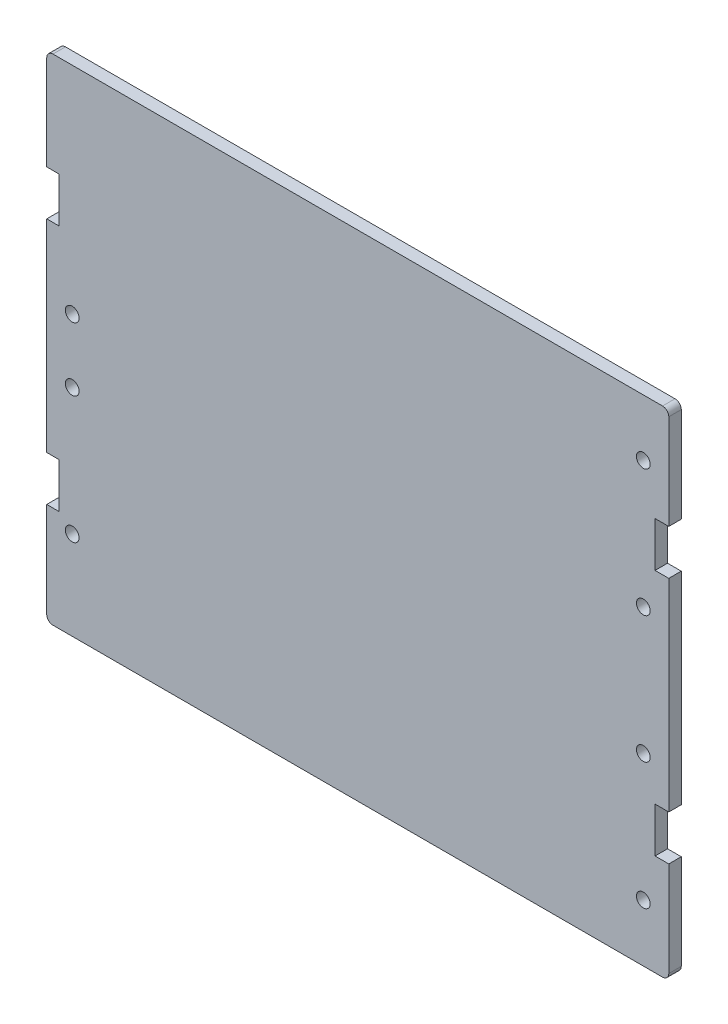
ISO-10303-21;
HEADER;
FILE_DESCRIPTION(('STEP AP214'),'2;1');
FILE_NAME('part.step','',(''),(''),'','','');
FILE_SCHEMA(('AUTOMOTIVE_DESIGN { 1 0 10303 214 1 1 1 1 }'));
ENDSEC;
DATA;
#1=APPLICATION_CONTEXT('core data for automotive mechanical design processes');
#2=APPLICATION_PROTOCOL_DEFINITION('international standard','automotive_design',2000,#1);
#3=PRODUCT_CONTEXT('',#1,'mechanical');
#4=PRODUCT('Part','Part','',(#3));
#5=PRODUCT_RELATED_PRODUCT_CATEGORY('part','',(#4));
#6=PRODUCT_DEFINITION_FORMATION('','',#4);
#7=PRODUCT_DEFINITION_CONTEXT('part definition',#1,'design');
#8=PRODUCT_DEFINITION('design','',#6,#7);
#9=PRODUCT_DEFINITION_SHAPE('','',#8);
#10=(LENGTH_UNIT() NAMED_UNIT(*) SI_UNIT(.MILLI.,.METRE.));
#11=(NAMED_UNIT(*) PLANE_ANGLE_UNIT() SI_UNIT($,.RADIAN.));
#12=(NAMED_UNIT(*) SI_UNIT($,.STERADIAN.) SOLID_ANGLE_UNIT());
#13=UNCERTAINTY_MEASURE_WITH_UNIT(LENGTH_MEASURE(1.E-05),#10,'distance_accuracy_value','');
#14=(GEOMETRIC_REPRESENTATION_CONTEXT(3) GLOBAL_UNCERTAINTY_ASSIGNED_CONTEXT((#13)) GLOBAL_UNIT_ASSIGNED_CONTEXT((#10,
#11,#12)) REPRESENTATION_CONTEXT('',''));
#15=CARTESIAN_POINT('',(0.,0.,0.));
#16=DIRECTION('',(0.,0.,1.));
#17=DIRECTION('',(1.,0.,0.));
#18=AXIS2_PLACEMENT_3D('',#15,#16,#17);
#19=CARTESIAN_POINT('',(-27.39,-21.78,8.3));
#20=DIRECTION('',(0.,0.,-1.));
#21=DIRECTION('',(-1.,0.,0.));
#22=AXIS2_PLACEMENT_3D('',#19,#20,#21);
#23=PLANE('',#22);
#24=CARTESIAN_POINT('',(-22.86,-2.54,8.3));
#25=DIRECTION('',(0.,0.,-1.));
#26=DIRECTION('',(-1.,0.,0.));
#27=AXIS2_PLACEMENT_3D('',#24,#25,#26);
#28=CIRCLE('',#27,0.550000000000003);
#29=CARTESIAN_POINT('',(-23.41,-2.54,8.3));
#30=VERTEX_POINT('',#29);
#31=EDGE_CURVE('E214',#30,#30,#28,.F.);
#32=ORIENTED_EDGE('',*,*,#31,.T.);
#33=EDGE_LOOP('',(#32));
#34=FACE_BOUND('',#33,.T.);
#35=CARTESIAN_POINT('',(22.86,15.26,8.3));
#36=DIRECTION('',(0.,0.,-1.));
#37=DIRECTION('',(-1.,0.,0.));
#38=AXIS2_PLACEMENT_3D('',#35,#36,#37);
#39=CIRCLE('',#38,0.549999999999998);
#40=CARTESIAN_POINT('',(22.31,15.26,8.3));
#41=VERTEX_POINT('',#40);
#42=EDGE_CURVE('E387',#41,#41,#39,.F.);
#43=ORIENTED_EDGE('',*,*,#42,.T.);
#44=EDGE_LOOP('',(#43));
#45=FACE_BOUND('',#44,.T.);
#46=CARTESIAN_POINT('',(22.86,-5.06000000000002,8.3));
#47=DIRECTION('',(0.,0.,-1.));
#48=DIRECTION('',(-1.,0.,0.));
#49=AXIS2_PLACEMENT_3D('',#46,#47,#48);
#50=CIRCLE('',#49,0.549999999999997);
#51=CARTESIAN_POINT('',(22.31,-5.06000000000002,8.3));
#52=VERTEX_POINT('',#51);
#53=EDGE_CURVE('E390',#52,#52,#50,.F.);
#54=ORIENTED_EDGE('',*,*,#53,.T.);
#55=EDGE_LOOP('',(#54));
#56=FACE_BOUND('',#55,.T.);
#57=CARTESIAN_POINT('',(22.86,-15.22,8.3));
#58=DIRECTION('',(0.,0.,-1.));
#59=DIRECTION('',(-1.,0.,0.));
#60=AXIS2_PLACEMENT_3D('',#57,#58,#59);
#61=CIRCLE('',#60,0.549999999999997);
#62=CARTESIAN_POINT('',(22.31,-15.22,8.3));
#63=VERTEX_POINT('',#62);
#64=EDGE_CURVE('E393',#63,#63,#61,.F.);
#65=ORIENTED_EDGE('',*,*,#64,.T.);
#66=EDGE_LOOP('',(#65));
#67=FACE_BOUND('',#66,.T.);
#68=CARTESIAN_POINT('',(22.86,5.09999999999998,8.3));
#69=DIRECTION('',(0.,0.,-1.));
#70=DIRECTION('',(-1.,0.,0.));
#71=AXIS2_PLACEMENT_3D('',#68,#69,#70);
#72=CIRCLE('',#71,0.549999999999997);
#73=CARTESIAN_POINT('',(22.31,5.09999999999998,8.3));
#74=VERTEX_POINT('',#73);
#75=EDGE_CURVE('E396',#74,#74,#72,.F.);
#76=ORIENTED_EDGE('',*,*,#75,.T.);
#77=EDGE_LOOP('',(#76));
#78=FACE_BOUND('',#77,.T.);
#79=CARTESIAN_POINT('',(-22.86,2.54,8.3));
#80=DIRECTION('',(0.,0.,-1.));
#81=DIRECTION('',(-1.,0.,0.));
#82=AXIS2_PLACEMENT_3D('',#79,#80,#81);
#83=CIRCLE('',#82,0.550000000000003);
#84=CARTESIAN_POINT('',(-23.41,2.54,8.3));
#85=VERTEX_POINT('',#84);
#86=EDGE_CURVE('E399',#85,#85,#83,.F.);
#87=ORIENTED_EDGE('',*,*,#86,.T.);
#88=EDGE_LOOP('',(#87));
#89=FACE_BOUND('',#88,.T.);
#90=CARTESIAN_POINT('',(-22.86,-12.7,8.3));
#91=DIRECTION('',(0.,0.,-1.));
#92=DIRECTION('',(-1.,0.,0.));
#93=AXIS2_PLACEMENT_3D('',#90,#91,#92);
#94=CIRCLE('',#93,0.550000000000002);
#95=CARTESIAN_POINT('',(-23.41,-12.7,8.3));
#96=VERTEX_POINT('',#95);
#97=EDGE_CURVE('E244',#96,#96,#94,.F.);
#98=ORIENTED_EDGE('',*,*,#97,.T.);
#99=EDGE_LOOP('',(#98));
#100=FACE_BOUND('',#99,.T.);
#101=DIRECTION('',(1.,0.,0.));
#102=VECTOR('',#101,1.);
#103=CARTESIAN_POINT('',(23.745,-11.7,8.3));
#104=LINE('',#103,#102);
#105=CARTESIAN_POINT('',(24.9,-11.7,8.3));
#106=VERTEX_POINT('',#105);
#107=CARTESIAN_POINT('',(23.8,-11.7,8.3));
#108=VERTEX_POINT('',#107);
#109=EDGE_CURVE('E340',#106,#108,#104,.F.);
#110=ORIENTED_EDGE('',*,*,#109,.F.);
#111=DIRECTION('',(0.,1.,0.));
#112=VECTOR('',#111,1.);
#113=CARTESIAN_POINT('',(24.9,-11.32,8.3));
#114=LINE('',#113,#112);
#115=CARTESIAN_POINT('',(24.9,-19.3,8.3));
#116=VERTEX_POINT('',#115);
#117=EDGE_CURVE('E343',#116,#106,#114,.T.);
#118=ORIENTED_EDGE('',*,*,#117,.F.);
#119=CARTESIAN_POINT('',(24.4,-19.3,8.3));
#120=DIRECTION('',(0.,0.,-1.));
#121=DIRECTION('',(-1.,0.,0.));
#122=AXIS2_PLACEMENT_3D('',#119,#120,#121);
#123=CIRCLE('',#122,0.500000000000035);
#124=CARTESIAN_POINT('',(24.4,-19.8,8.3));
#125=VERTEX_POINT('',#124);
#126=EDGE_CURVE('E190',#125,#116,#123,.F.);
#127=ORIENTED_EDGE('',*,*,#126,.F.);
#128=DIRECTION('',(1.,0.,0.));
#129=VECTOR('',#128,1.);
#130=CARTESIAN_POINT('',(-26.84,-19.8,8.3));
#131=LINE('',#130,#129);
#132=CARTESIAN_POINT('',(-24.4,-19.8,8.3));
#133=VERTEX_POINT('',#132);
#134=EDGE_CURVE('E188',#133,#125,#131,.T.);
#135=ORIENTED_EDGE('',*,*,#134,.F.);
#136=CARTESIAN_POINT('',(-24.4,-19.3,8.3));
#137=DIRECTION('',(0.,0.,-1.));
#138=DIRECTION('',(-1.,0.,0.));
#139=AXIS2_PLACEMENT_3D('',#136,#137,#138);
#140=CIRCLE('',#139,0.500000000000035);
#141=CARTESIAN_POINT('',(-24.9,-19.3,8.3));
#142=VERTEX_POINT('',#141);
#143=EDGE_CURVE('E20',#142,#133,#140,.F.);
#144=ORIENTED_EDGE('',*,*,#143,.F.);
#145=DIRECTION('',(0.,-1.,0.));
#146=VECTOR('',#145,1.);
#147=CARTESIAN_POINT('',(-24.9,-11.29375,8.3));
#148=LINE('',#147,#146);
#149=CARTESIAN_POINT('',(-24.9,-11.675,8.3));
#150=VERTEX_POINT('',#149);
#151=EDGE_CURVE('E186',#150,#142,#148,.T.);
#152=ORIENTED_EDGE('',*,*,#151,.F.);
#153=DIRECTION('',(1.,0.,0.));
#154=VECTOR('',#153,1.);
#155=CARTESIAN_POINT('',(-24.95,-11.675,8.3));
#156=LINE('',#155,#154);
#157=CARTESIAN_POINT('',(-23.9,-11.675,8.3));
#158=VERTEX_POINT('',#157);
#159=EDGE_CURVE('E207',#158,#150,#156,.F.);
#160=ORIENTED_EDGE('',*,*,#159,.F.);
#161=DIRECTION('',(0.,-1.,0.));
#162=VECTOR('',#161,1.);
#163=CARTESIAN_POINT('',(-23.9,-7.89500000000001,8.3));
#164=LINE('',#163,#162);
#165=CARTESIAN_POINT('',(-23.9,-8.07500000000001,8.3));
#166=VERTEX_POINT('',#165);
#167=EDGE_CURVE('E220',#166,#158,#164,.T.);
#168=ORIENTED_EDGE('',*,*,#167,.F.);
#169=DIRECTION('',(1.,0.,0.));
#170=VECTOR('',#169,1.);
#171=CARTESIAN_POINT('',(-24.95,-8.07500000000002,8.3));
#172=LINE('',#171,#170);
#173=CARTESIAN_POINT('',(-24.9,-8.07500000000002,8.3));
#174=VERTEX_POINT('',#173);
#175=EDGE_CURVE('E238',#174,#166,#172,.T.);
#176=ORIENTED_EDGE('',*,*,#175,.F.);
#177=DIRECTION('',(0.,-1.,0.));
#178=VECTOR('',#177,1.);
#179=CARTESIAN_POINT('',(-24.9,8.93499999999999,8.3));
#180=LINE('',#179,#178);
#181=CARTESIAN_POINT('',(-24.9,8.12499999999999,8.3));
#182=VERTEX_POINT('',#181);
#183=EDGE_CURVE('E247',#182,#174,#180,.T.);
#184=ORIENTED_EDGE('',*,*,#183,.F.);
#185=DIRECTION('',(1.,0.,0.));
#186=VECTOR('',#185,1.);
#187=CARTESIAN_POINT('',(-24.95,8.12499999999999,8.3));
#188=LINE('',#187,#186);
#189=CARTESIAN_POINT('',(-23.9,8.12499999999999,8.3));
#190=VERTEX_POINT('',#189);
#191=EDGE_CURVE('E257',#190,#182,#188,.F.);
#192=ORIENTED_EDGE('',*,*,#191,.F.);
#193=DIRECTION('',(0.,-1.,0.));
#194=VECTOR('',#193,1.);
#195=CARTESIAN_POINT('',(-23.9,11.905,8.3));
#196=LINE('',#195,#194);
#197=CARTESIAN_POINT('',(-23.9,11.725,8.3));
#198=VERTEX_POINT('',#197);
#199=EDGE_CURVE('E267',#198,#190,#196,.T.);
#200=ORIENTED_EDGE('',*,*,#199,.F.);
#201=DIRECTION('',(1.,0.,0.));
#202=VECTOR('',#201,1.);
#203=CARTESIAN_POINT('',(-24.95,11.725,8.3));
#204=LINE('',#203,#202);
#205=CARTESIAN_POINT('',(-24.9,11.725,8.3));
#206=VERTEX_POINT('',#205);
#207=EDGE_CURVE('E277',#206,#198,#204,.T.);
#208=ORIENTED_EDGE('',*,*,#207,.F.);
#209=DIRECTION('',(0.,-1.,0.));
#210=VECTOR('',#209,1.);
#211=CARTESIAN_POINT('',(-24.9,19.67875,8.3));
#212=LINE('',#211,#210);
#213=CARTESIAN_POINT('',(-24.9,19.3,8.3));
#214=VERTEX_POINT('',#213);
#215=EDGE_CURVE('E280',#214,#206,#212,.T.);
#216=ORIENTED_EDGE('',*,*,#215,.F.);
#217=CARTESIAN_POINT('',(-24.4,19.3,8.3));
#218=DIRECTION('',(0.,0.,-1.));
#219=DIRECTION('',(-1.,0.,0.));
#220=AXIS2_PLACEMENT_3D('',#217,#218,#219);
#221=CIRCLE('',#220,0.500000000000035);
#222=CARTESIAN_POINT('',(-24.4,19.8,8.3));
#223=VERTEX_POINT('',#222);
#224=EDGE_CURVE('E295',#223,#214,#221,.F.);
#225=ORIENTED_EDGE('',*,*,#224,.F.);
#226=DIRECTION('',(1.,0.,0.));
#227=VECTOR('',#226,1.);
#228=CARTESIAN_POINT('',(-26.84,19.8,8.3));
#229=LINE('',#228,#227);
#230=CARTESIAN_POINT('',(24.4,19.8,8.3));
#231=VERTEX_POINT('',#230);
#232=EDGE_CURVE('E292',#231,#223,#229,.F.);
#233=ORIENTED_EDGE('',*,*,#232,.F.);
#234=CARTESIAN_POINT('',(24.4,19.3,8.3));
#235=DIRECTION('',(0.,0.,-1.));
#236=DIRECTION('',(-1.,0.,0.));
#237=AXIS2_PLACEMENT_3D('',#234,#235,#236);
#238=CIRCLE('',#237,0.500000000000035);
#239=CARTESIAN_POINT('',(24.9,19.3,8.3));
#240=VERTEX_POINT('',#239);
#241=EDGE_CURVE('E300',#240,#231,#238,.F.);
#242=ORIENTED_EDGE('',*,*,#241,.F.);
#243=DIRECTION('',(0.,1.,0.));
#244=VECTOR('',#243,1.);
#245=CARTESIAN_POINT('',(24.9,19.68,8.3));
#246=LINE('',#245,#244);
#247=CARTESIAN_POINT('',(24.9,11.7,8.3));
#248=VERTEX_POINT('',#247);
#249=EDGE_CURVE('E297',#248,#240,#246,.T.);
#250=ORIENTED_EDGE('',*,*,#249,.F.);
#251=DIRECTION('',(1.,0.,0.));
#252=VECTOR('',#251,1.);
#253=CARTESIAN_POINT('',(23.745,11.7,8.3));
#254=LINE('',#253,#252);
#255=CARTESIAN_POINT('',(23.8,11.7,8.3));
#256=VERTEX_POINT('',#255);
#257=EDGE_CURVE('E304',#256,#248,#254,.T.);
#258=ORIENTED_EDGE('',*,*,#257,.F.);
#259=DIRECTION('',(0.,1.,0.));
#260=VECTOR('',#259,1.);
#261=CARTESIAN_POINT('',(23.8,11.88,8.3));
#262=LINE('',#261,#260);
#263=CARTESIAN_POINT('',(23.8,8.09999999999999,8.3));
#264=VERTEX_POINT('',#263);
#265=EDGE_CURVE('E310',#264,#256,#262,.T.);
#266=ORIENTED_EDGE('',*,*,#265,.F.);
#267=DIRECTION('',(1.,0.,0.));
#268=VECTOR('',#267,1.);
#269=CARTESIAN_POINT('',(23.745,8.09999999999999,8.3));
#270=LINE('',#269,#268);
#271=CARTESIAN_POINT('',(24.9,8.09999999999999,8.3));
#272=VERTEX_POINT('',#271);
#273=EDGE_CURVE('E316',#272,#264,#270,.F.);
#274=ORIENTED_EDGE('',*,*,#273,.F.);
#275=DIRECTION('',(0.,1.,0.));
#276=VECTOR('',#275,1.);
#277=CARTESIAN_POINT('',(24.9,8.91,8.3));
#278=LINE('',#277,#276);
#279=CARTESIAN_POINT('',(24.9,-8.1,8.3));
#280=VERTEX_POINT('',#279);
#281=EDGE_CURVE('E322',#280,#272,#278,.T.);
#282=ORIENTED_EDGE('',*,*,#281,.F.);
#283=DIRECTION('',(1.,0.,0.));
#284=VECTOR('',#283,1.);
#285=CARTESIAN_POINT('',(23.745,-8.1,8.3));
#286=LINE('',#285,#284);
#287=CARTESIAN_POINT('',(23.8,-8.1,8.3));
#288=VERTEX_POINT('',#287);
#289=EDGE_CURVE('E328',#288,#280,#286,.T.);
#290=ORIENTED_EDGE('',*,*,#289,.F.);
#291=DIRECTION('',(0.,1.,0.));
#292=VECTOR('',#291,1.);
#293=CARTESIAN_POINT('',(23.8,-7.92,8.3));
#294=LINE('',#293,#292);
#295=EDGE_CURVE('E334',#108,#288,#294,.T.);
#296=ORIENTED_EDGE('',*,*,#295,.F.);
#297=EDGE_LOOP('',(#110,#118,#127,#135,#144,#152,#160,#168,#176,#184,#192,#200,#208,#216,#225,
#233,#242,#250,#258,#266,#274,#282,#290,#296));
#298=FACE_BOUND('',#297,.T.);
#299=ADVANCED_FACE('F17',(#34,#45,#56,#67,#78,#89,#100,#298),#23,.T.);
#300=CARTESIAN_POINT('',(-24.95,-11.675,8.25));
#301=DIRECTION('',(0.,1.,0.));
#302=DIRECTION('',(0.,0.,1.));
#303=AXIS2_PLACEMENT_3D('',#300,#301,#302);
#304=PLANE('',#303);
#305=DIRECTION('',(1.,0.,0.));
#306=VECTOR('',#305,1.);
#307=CARTESIAN_POINT('',(-27.39,-11.675,9.3));
#308=LINE('',#307,#306);
#309=CARTESIAN_POINT('',(-23.9,-11.675,9.3));
#310=VERTEX_POINT('',#309);
#311=CARTESIAN_POINT('',(-24.9,-11.675,9.3));
#312=VERTEX_POINT('',#311);
#313=EDGE_CURVE('E210',#310,#312,#308,.F.);
#314=ORIENTED_EDGE('',*,*,#313,.F.);
#315=DIRECTION('',(0.,0.,1.));
#316=VECTOR('',#315,1.);
#317=CARTESIAN_POINT('',(-23.9,-11.675,9.35));
#318=LINE('',#317,#316);
#319=EDGE_CURVE('E217',#158,#310,#318,.T.);
#320=ORIENTED_EDGE('',*,*,#319,.F.);
#321=ORIENTED_EDGE('',*,*,#159,.T.);
#322=DIRECTION('',(0.,0.,1.));
#323=VECTOR('',#322,1.);
#324=CARTESIAN_POINT('',(-24.9,-11.675,9.35));
#325=LINE('',#324,#323);
#326=EDGE_CURVE('E204',#312,#150,#325,.F.);
#327=ORIENTED_EDGE('',*,*,#326,.F.);
#328=EDGE_LOOP('',(#314,#320,#321,#327));
#329=FACE_BOUND('',#328,.T.);
#330=ADVANCED_FACE('F974',(#329),#304,.T.);
#331=CARTESIAN_POINT('',(-24.9,-11.29375,9.35));
#332=DIRECTION('',(-1.,0.,0.));
#333=DIRECTION('',(0.,-1.,0.));
#334=AXIS2_PLACEMENT_3D('',#331,#332,#333);
#335=PLANE('',#334);
#336=DIRECTION('',(0.,0.,-1.));
#337=VECTOR('',#336,1.);
#338=CARTESIAN_POINT('',(-24.9,-19.3,9.3));
#339=LINE('',#338,#337);
#340=CARTESIAN_POINT('',(-24.9,-19.3,9.3));
#341=VERTEX_POINT('',#340);
#342=EDGE_CURVE('E185',#341,#142,#339,.T.);
#343=ORIENTED_EDGE('',*,*,#342,.F.);
#344=DIRECTION('',(0.,1.,0.));
#345=VECTOR('',#344,1.);
#346=CARTESIAN_POINT('',(-24.9,21.78,9.3));
#347=LINE('',#346,#345);
#348=EDGE_CURVE('E213',#312,#341,#347,.F.);
#349=ORIENTED_EDGE('',*,*,#348,.F.);
#350=ORIENTED_EDGE('',*,*,#326,.T.);
#351=ORIENTED_EDGE('',*,*,#151,.T.);
#352=EDGE_LOOP('',(#343,#349,#350,#351));
#353=FACE_BOUND('',#352,.T.);
#354=ADVANCED_FACE('F964',(#353),#335,.T.);
#355=CARTESIAN_POINT('',(-24.4,-19.3,9.3));
#356=DIRECTION('',(0.,0.,-1.));
#357=DIRECTION('',(-1.,0.,0.));
#358=AXIS2_PLACEMENT_3D('',#355,#356,#357);
#359=CYLINDRICAL_SURFACE('',#358,0.500000000000035);
#360=CARTESIAN_POINT('',(-24.4,-19.3,9.3));
#361=DIRECTION('',(0.,0.,-1.));
#362=DIRECTION('',(-1.,0.,0.));
#363=AXIS2_PLACEMENT_3D('',#360,#361,#362);
#364=CIRCLE('',#363,0.500000000000035);
#365=CARTESIAN_POINT('',(-24.4,-19.8,9.3));
#366=VERTEX_POINT('',#365);
#367=EDGE_CURVE('E383',#341,#366,#364,.F.);
#368=ORIENTED_EDGE('',*,*,#367,.F.);
#369=ORIENTED_EDGE('',*,*,#342,.T.);
#370=ORIENTED_EDGE('',*,*,#143,.T.);
#371=DIRECTION('',(0.,0.,1.));
#372=VECTOR('',#371,1.);
#373=CARTESIAN_POINT('',(-24.4,-19.8,9.35));
#374=LINE('',#373,#372);
#375=EDGE_CURVE('E183',#366,#133,#374,.F.);
#376=ORIENTED_EDGE('',*,*,#375,.F.);
#377=EDGE_LOOP('',(#368,#369,#370,#376));
#378=FACE_BOUND('',#377,.T.);
#379=ADVANCED_FACE('F181',(#378),#359,.T.);
#380=CARTESIAN_POINT('',(-26.84,-19.8,9.35));
#381=DIRECTION('',(0.,-1.,0.));
#382=DIRECTION('',(1.,0.,0.));
#383=AXIS2_PLACEMENT_3D('',#380,#381,#382);
#384=PLANE('',#383);
#385=ORIENTED_EDGE('',*,*,#375,.T.);
#386=ORIENTED_EDGE('',*,*,#134,.T.);
#387=DIRECTION('',(0.,0.,-1.));
#388=VECTOR('',#387,1.);
#389=CARTESIAN_POINT('',(24.4,-19.8,9.3));
#390=LINE('',#389,#388);
#391=CARTESIAN_POINT('',(24.4,-19.8,9.3));
#392=VERTEX_POINT('',#391);
#393=EDGE_CURVE('E201',#392,#125,#390,.T.);
#394=ORIENTED_EDGE('',*,*,#393,.F.);
#395=DIRECTION('',(1.,0.,0.));
#396=VECTOR('',#395,1.);
#397=CARTESIAN_POINT('',(-27.39,-19.8,9.3));
#398=LINE('',#397,#396);
#399=EDGE_CURVE('E196',#366,#392,#398,.T.);
#400=ORIENTED_EDGE('',*,*,#399,.F.);
#401=EDGE_LOOP('',(#385,#386,#394,#400));
#402=FACE_BOUND('',#401,.T.);
#403=ADVANCED_FACE('F194',(#402),#384,.T.);
#404=CARTESIAN_POINT('',(24.4,-19.3,9.3));
#405=DIRECTION('',(0.,0.,-1.));
#406=DIRECTION('',(-1.,0.,0.));
#407=AXIS2_PLACEMENT_3D('',#404,#405,#406);
#408=CYLINDRICAL_SURFACE('',#407,0.500000000000035);
#409=CARTESIAN_POINT('',(24.4,-19.3,9.3));
#410=DIRECTION('',(0.,0.,-1.));
#411=DIRECTION('',(-1.,0.,0.));
#412=AXIS2_PLACEMENT_3D('',#409,#410,#411);
#413=CIRCLE('',#412,0.500000000000035);
#414=CARTESIAN_POINT('',(24.9,-19.3,9.3));
#415=VERTEX_POINT('',#414);
#416=EDGE_CURVE('E379',#392,#415,#413,.F.);
#417=ORIENTED_EDGE('',*,*,#416,.F.);
#418=ORIENTED_EDGE('',*,*,#393,.T.);
#419=ORIENTED_EDGE('',*,*,#126,.T.);
#420=DIRECTION('',(0.,0.,1.));
#421=VECTOR('',#420,1.);
#422=CARTESIAN_POINT('',(24.9,-19.3,8.25));
#423=LINE('',#422,#421);
#424=EDGE_CURVE('E348',#415,#116,#423,.F.);
#425=ORIENTED_EDGE('',*,*,#424,.F.);
#426=EDGE_LOOP('',(#417,#418,#419,#425));
#427=FACE_BOUND('',#426,.T.);
#428=ADVANCED_FACE('F581',(#427),#408,.T.);
#429=CARTESIAN_POINT('',(24.9,-11.32,8.25));
#430=DIRECTION('',(1.,0.,0.));
#431=DIRECTION('',(0.,1.,0.));
#432=AXIS2_PLACEMENT_3D('',#429,#430,#431);
#433=PLANE('',#432);
#434=ORIENTED_EDGE('',*,*,#424,.T.);
#435=ORIENTED_EDGE('',*,*,#117,.T.);
#436=DIRECTION('',(0.,0.,1.));
#437=VECTOR('',#436,1.);
#438=CARTESIAN_POINT('',(24.9,-11.7,8.25));
#439=LINE('',#438,#437);
#440=CARTESIAN_POINT('',(24.9,-11.7,9.3));
#441=VERTEX_POINT('',#440);
#442=EDGE_CURVE('E337',#441,#106,#439,.F.);
#443=ORIENTED_EDGE('',*,*,#442,.F.);
#444=DIRECTION('',(0.,1.,0.));
#445=VECTOR('',#444,1.);
#446=CARTESIAN_POINT('',(24.9,21.78,9.3));
#447=LINE('',#446,#445);
#448=EDGE_CURVE('E382',#415,#441,#447,.T.);
#449=ORIENTED_EDGE('',*,*,#448,.F.);
#450=EDGE_LOOP('',(#434,#435,#443,#449));
#451=FACE_BOUND('',#450,.T.);
#452=ADVANCED_FACE('F580',(#451),#433,.T.);
#453=CARTESIAN_POINT('',(23.745,-11.7,8.25));
#454=DIRECTION('',(0.,1.,0.));
#455=DIRECTION('',(0.,0.,1.));
#456=AXIS2_PLACEMENT_3D('',#453,#454,#455);
#457=PLANE('',#456);
#458=DIRECTION('',(1.,0.,0.));
#459=VECTOR('',#458,1.);
#460=CARTESIAN_POINT('',(-27.39,-11.7,9.3));
#461=LINE('',#460,#459);
#462=CARTESIAN_POINT('',(23.8,-11.7,9.3));
#463=VERTEX_POINT('',#462);
#464=EDGE_CURVE('E419',#441,#463,#461,.F.);
#465=ORIENTED_EDGE('',*,*,#464,.F.);
#466=ORIENTED_EDGE('',*,*,#442,.T.);
#467=ORIENTED_EDGE('',*,*,#109,.T.);
#468=DIRECTION('',(0.,0.,1.));
#469=VECTOR('',#468,1.);
#470=CARTESIAN_POINT('',(23.8,-11.7,8.25));
#471=LINE('',#470,#469);
#472=EDGE_CURVE('E331',#463,#108,#471,.F.);
#473=ORIENTED_EDGE('',*,*,#472,.F.);
#474=EDGE_LOOP('',(#465,#466,#467,#473));
#475=FACE_BOUND('',#474,.T.);
#476=ADVANCED_FACE('F579',(#475),#457,.T.);
#477=CARTESIAN_POINT('',(23.8,-7.92,8.25));
#478=DIRECTION('',(1.,0.,0.));
#479=DIRECTION('',(0.,1.,0.));
#480=AXIS2_PLACEMENT_3D('',#477,#478,#479);
#481=PLANE('',#480);
#482=DIRECTION('',(0.,1.,0.));
#483=VECTOR('',#482,1.);
#484=CARTESIAN_POINT('',(23.8,21.78,9.3));
#485=LINE('',#484,#483);
#486=CARTESIAN_POINT('',(23.8,-8.1,9.3));
#487=VERTEX_POINT('',#486);
#488=EDGE_CURVE('E422',#463,#487,#485,.T.);
#489=ORIENTED_EDGE('',*,*,#488,.F.);
#490=ORIENTED_EDGE('',*,*,#472,.T.);
#491=ORIENTED_EDGE('',*,*,#295,.T.);
#492=DIRECTION('',(0.,0.,1.));
#493=VECTOR('',#492,1.);
#494=CARTESIAN_POINT('',(23.8,-8.1,9.35));
#495=LINE('',#494,#493);
#496=EDGE_CURVE('E325',#487,#288,#495,.F.);
#497=ORIENTED_EDGE('',*,*,#496,.F.);
#498=EDGE_LOOP('',(#489,#490,#491,#497));
#499=FACE_BOUND('',#498,.T.);
#500=ADVANCED_FACE('F576',(#499),#481,.T.);
#501=CARTESIAN_POINT('',(23.745,-8.1,9.35));
#502=DIRECTION('',(0.,-1.,0.));
#503=DIRECTION('',(1.,0.,0.));
#504=AXIS2_PLACEMENT_3D('',#501,#502,#503);
#505=PLANE('',#504);
#506=DIRECTION('',(1.,0.,0.));
#507=VECTOR('',#506,1.);
#508=CARTESIAN_POINT('',(-27.39,-8.1,9.3));
#509=LINE('',#508,#507);
#510=CARTESIAN_POINT('',(24.9,-8.1,9.3));
#511=VERTEX_POINT('',#510);
#512=EDGE_CURVE('E431',#487,#511,#509,.T.);
#513=ORIENTED_EDGE('',*,*,#512,.F.);
#514=ORIENTED_EDGE('',*,*,#496,.T.);
#515=ORIENTED_EDGE('',*,*,#289,.T.);
#516=DIRECTION('',(0.,0.,1.));
#517=VECTOR('',#516,1.);
#518=CARTESIAN_POINT('',(24.9,-8.1,8.25));
#519=LINE('',#518,#517);
#520=EDGE_CURVE('E319',#511,#280,#519,.F.);
#521=ORIENTED_EDGE('',*,*,#520,.F.);
#522=EDGE_LOOP('',(#513,#514,#515,#521));
#523=FACE_BOUND('',#522,.T.);
#524=ADVANCED_FACE('F573',(#523),#505,.T.);
#525=CARTESIAN_POINT('',(24.9,8.91,8.25));
#526=DIRECTION('',(1.,0.,0.));
#527=DIRECTION('',(0.,1.,0.));
#528=AXIS2_PLACEMENT_3D('',#525,#526,#527);
#529=PLANE('',#528);
#530=DIRECTION('',(0.,1.,0.));
#531=VECTOR('',#530,1.);
#532=CARTESIAN_POINT('',(24.9,21.78,9.3));
#533=LINE('',#532,#531);
#534=CARTESIAN_POINT('',(24.9,8.09999999999999,9.3));
#535=VERTEX_POINT('',#534);
#536=EDGE_CURVE('E440',#511,#535,#533,.T.);
#537=ORIENTED_EDGE('',*,*,#536,.F.);
#538=ORIENTED_EDGE('',*,*,#520,.T.);
#539=ORIENTED_EDGE('',*,*,#281,.T.);
#540=DIRECTION('',(0.,0.,1.));
#541=VECTOR('',#540,1.);
#542=CARTESIAN_POINT('',(24.9,8.09999999999999,8.25));
#543=LINE('',#542,#541);
#544=EDGE_CURVE('E313',#535,#272,#543,.F.);
#545=ORIENTED_EDGE('',*,*,#544,.F.);
#546=EDGE_LOOP('',(#537,#538,#539,#545));
#547=FACE_BOUND('',#546,.T.);
#548=ADVANCED_FACE('F570',(#547),#529,.T.);
#549=CARTESIAN_POINT('',(23.745,8.09999999999999,8.25));
#550=DIRECTION('',(0.,1.,0.));
#551=DIRECTION('',(0.,0.,1.));
#552=AXIS2_PLACEMENT_3D('',#549,#550,#551);
#553=PLANE('',#552);
#554=DIRECTION('',(1.,0.,0.));
#555=VECTOR('',#554,1.);
#556=CARTESIAN_POINT('',(-27.39,8.09999999999999,9.3));
#557=LINE('',#556,#555);
#558=CARTESIAN_POINT('',(23.8,8.09999999999999,9.3));
#559=VERTEX_POINT('',#558);
#560=EDGE_CURVE('E449',#535,#559,#557,.F.);
#561=ORIENTED_EDGE('',*,*,#560,.F.);
#562=ORIENTED_EDGE('',*,*,#544,.T.);
#563=ORIENTED_EDGE('',*,*,#273,.T.);
#564=DIRECTION('',(0.,0.,1.));
#565=VECTOR('',#564,1.);
#566=CARTESIAN_POINT('',(23.8,8.09999999999999,8.25));
#567=LINE('',#566,#565);
#568=EDGE_CURVE('E307',#559,#264,#567,.F.);
#569=ORIENTED_EDGE('',*,*,#568,.F.);
#570=EDGE_LOOP('',(#561,#562,#563,#569));
#571=FACE_BOUND('',#570,.T.);
#572=ADVANCED_FACE('F567',(#571),#553,.T.);
#573=CARTESIAN_POINT('',(23.8,11.88,8.25));
#574=DIRECTION('',(1.,0.,0.));
#575=DIRECTION('',(0.,1.,0.));
#576=AXIS2_PLACEMENT_3D('',#573,#574,#575);
#577=PLANE('',#576);
#578=DIRECTION('',(0.,1.,0.));
#579=VECTOR('',#578,1.);
#580=CARTESIAN_POINT('',(23.8,21.78,9.3));
#581=LINE('',#580,#579);
#582=CARTESIAN_POINT('',(23.8,11.7,9.3));
#583=VERTEX_POINT('',#582);
#584=EDGE_CURVE('E458',#559,#583,#581,.T.);
#585=ORIENTED_EDGE('',*,*,#584,.F.);
#586=ORIENTED_EDGE('',*,*,#568,.T.);
#587=ORIENTED_EDGE('',*,*,#265,.T.);
#588=DIRECTION('',(0.,0.,1.));
#589=VECTOR('',#588,1.);
#590=CARTESIAN_POINT('',(23.8,11.7,9.35));
#591=LINE('',#590,#589);
#592=EDGE_CURVE('E306',#583,#256,#591,.F.);
#593=ORIENTED_EDGE('',*,*,#592,.F.);
#594=EDGE_LOOP('',(#585,#586,#587,#593));
#595=FACE_BOUND('',#594,.T.);
#596=ADVANCED_FACE('F564',(#595),#577,.T.);
#597=CARTESIAN_POINT('',(23.745,11.7,9.35));
#598=DIRECTION('',(0.,-1.,0.));
#599=DIRECTION('',(1.,0.,0.));
#600=AXIS2_PLACEMENT_3D('',#597,#598,#599);
#601=PLANE('',#600);
#602=DIRECTION('',(1.,0.,0.));
#603=VECTOR('',#602,1.);
#604=CARTESIAN_POINT('',(-27.39,11.7,9.3));
#605=LINE('',#604,#603);
#606=CARTESIAN_POINT('',(24.9,11.7,9.3));
#607=VERTEX_POINT('',#606);
#608=EDGE_CURVE('E467',#583,#607,#605,.T.);
#609=ORIENTED_EDGE('',*,*,#608,.F.);
#610=ORIENTED_EDGE('',*,*,#592,.T.);
#611=ORIENTED_EDGE('',*,*,#257,.T.);
#612=DIRECTION('',(0.,0.,1.));
#613=VECTOR('',#612,1.);
#614=CARTESIAN_POINT('',(24.9,11.7,8.25));
#615=LINE('',#614,#613);
#616=EDGE_CURVE('E301',#607,#248,#615,.F.);
#617=ORIENTED_EDGE('',*,*,#616,.F.);
#618=EDGE_LOOP('',(#609,#610,#611,#617));
#619=FACE_BOUND('',#618,.T.);
#620=ADVANCED_FACE('F561',(#619),#601,.T.);
#621=CARTESIAN_POINT('',(24.9,19.68,8.25));
#622=DIRECTION('',(1.,0.,0.));
#623=DIRECTION('',(0.,1.,0.));
#624=AXIS2_PLACEMENT_3D('',#621,#622,#623);
#625=PLANE('',#624);
#626=DIRECTION('',(0.,0.,-1.));
#627=VECTOR('',#626,1.);
#628=CARTESIAN_POINT('',(24.9,19.3,9.3));
#629=LINE('',#628,#627);
#630=CARTESIAN_POINT('',(24.9,19.3,9.3));
#631=VERTEX_POINT('',#630);
#632=EDGE_CURVE('E406',#631,#240,#629,.T.);
#633=ORIENTED_EDGE('',*,*,#632,.F.);
#634=DIRECTION('',(0.,1.,0.));
#635=VECTOR('',#634,1.);
#636=CARTESIAN_POINT('',(24.9,21.78,9.3));
#637=LINE('',#636,#635);
#638=EDGE_CURVE('E378',#607,#631,#637,.T.);
#639=ORIENTED_EDGE('',*,*,#638,.F.);
#640=ORIENTED_EDGE('',*,*,#616,.T.);
#641=ORIENTED_EDGE('',*,*,#249,.T.);
#642=EDGE_LOOP('',(#633,#639,#640,#641));
#643=FACE_BOUND('',#642,.T.);
#644=ADVANCED_FACE('F558',(#643),#625,.T.);
#645=CARTESIAN_POINT('',(24.4,19.3,9.3));
#646=DIRECTION('',(0.,0.,-1.));
#647=DIRECTION('',(-1.,0.,0.));
#648=AXIS2_PLACEMENT_3D('',#645,#646,#647);
#649=CYLINDRICAL_SURFACE('',#648,0.500000000000035);
#650=CARTESIAN_POINT('',(24.4,19.3,9.3));
#651=DIRECTION('',(0.,0.,-1.));
#652=DIRECTION('',(-1.,0.,0.));
#653=AXIS2_PLACEMENT_3D('',#650,#651,#652);
#654=CIRCLE('',#653,0.500000000000035);
#655=CARTESIAN_POINT('',(24.4,19.8,9.3));
#656=VERTEX_POINT('',#655);
#657=EDGE_CURVE('E375',#631,#656,#654,.F.);
#658=ORIENTED_EDGE('',*,*,#657,.F.);
#659=ORIENTED_EDGE('',*,*,#632,.T.);
#660=ORIENTED_EDGE('',*,*,#241,.T.);
#661=DIRECTION('',(0.,0.,1.));
#662=VECTOR('',#661,1.);
#663=CARTESIAN_POINT('',(24.4,19.8,8.25));
#664=LINE('',#663,#662);
#665=EDGE_CURVE('E296',#656,#231,#664,.F.);
#666=ORIENTED_EDGE('',*,*,#665,.F.);
#667=EDGE_LOOP('',(#658,#659,#660,#666));
#668=FACE_BOUND('',#667,.T.);
#669=ADVANCED_FACE('F555',(#668),#649,.T.);
#670=CARTESIAN_POINT('',(-26.84,19.8,8.25));
#671=DIRECTION('',(0.,1.,0.));
#672=DIRECTION('',(0.,0.,1.));
#673=AXIS2_PLACEMENT_3D('',#670,#671,#672);
#674=PLANE('',#673);
#675=DIRECTION('',(0.,0.,-1.));
#676=VECTOR('',#675,1.);
#677=CARTESIAN_POINT('',(-24.4,19.8000000000001,9.3));
#678=LINE('',#677,#676);
#679=CARTESIAN_POINT('',(-24.4,19.8,9.3));
#680=VERTEX_POINT('',#679);
#681=EDGE_CURVE('E405',#680,#223,#678,.T.);
#682=ORIENTED_EDGE('',*,*,#681,.F.);
#683=DIRECTION('',(1.,0.,0.));
#684=VECTOR('',#683,1.);
#685=CARTESIAN_POINT('',(-27.39,19.8,9.3));
#686=LINE('',#685,#684);
#687=EDGE_CURVE('E374',#656,#680,#686,.F.);
#688=ORIENTED_EDGE('',*,*,#687,.F.);
#689=ORIENTED_EDGE('',*,*,#665,.T.);
#690=ORIENTED_EDGE('',*,*,#232,.T.);
#691=EDGE_LOOP('',(#682,#688,#689,#690));
#692=FACE_BOUND('',#691,.T.);
#693=ADVANCED_FACE('F548',(#692),#674,.T.);
#694=CARTESIAN_POINT('',(-24.4,19.3,9.3));
#695=DIRECTION('',(0.,0.,-1.));
#696=DIRECTION('',(-1.,0.,0.));
#697=AXIS2_PLACEMENT_3D('',#694,#695,#696);
#698=CYLINDRICAL_SURFACE('',#697,0.500000000000035);
#699=CARTESIAN_POINT('',(-24.4,19.3,9.3));
#700=DIRECTION('',(0.,0.,-1.));
#701=DIRECTION('',(-1.,0.,0.));
#702=AXIS2_PLACEMENT_3D('',#699,#700,#701);
#703=CIRCLE('',#702,0.500000000000035);
#704=CARTESIAN_POINT('',(-24.9,19.3,9.3));
#705=VERTEX_POINT('',#704);
#706=EDGE_CURVE('E370',#680,#705,#703,.F.);
#707=ORIENTED_EDGE('',*,*,#706,.F.);
#708=ORIENTED_EDGE('',*,*,#681,.T.);
#709=ORIENTED_EDGE('',*,*,#224,.T.);
#710=DIRECTION('',(0.,0.,1.));
#711=VECTOR('',#710,1.);
#712=CARTESIAN_POINT('',(-24.9,19.3,9.35));
#713=LINE('',#712,#711);
#714=EDGE_CURVE('E289',#705,#214,#713,.F.);
#715=ORIENTED_EDGE('',*,*,#714,.F.);
#716=EDGE_LOOP('',(#707,#708,#709,#715));
#717=FACE_BOUND('',#716,.T.);
#718=ADVANCED_FACE('F551',(#717),#698,.T.);
#719=CARTESIAN_POINT('',(-24.9,19.67875,9.35));
#720=DIRECTION('',(-1.,0.,0.));
#721=DIRECTION('',(0.,-1.,0.));
#722=AXIS2_PLACEMENT_3D('',#719,#720,#721);
#723=PLANE('',#722);
#724=ORIENTED_EDGE('',*,*,#714,.T.);
#725=ORIENTED_EDGE('',*,*,#215,.T.);
#726=DIRECTION('',(0.,0.,1.));
#727=VECTOR('',#726,1.);
#728=CARTESIAN_POINT('',(-24.9,11.725,9.35));
#729=LINE('',#728,#727);
#730=CARTESIAN_POINT('',(-24.9,11.725,9.3));
#731=VERTEX_POINT('',#730);
#732=EDGE_CURVE('E270',#731,#206,#729,.F.);
#733=ORIENTED_EDGE('',*,*,#732,.F.);
#734=DIRECTION('',(0.,1.,0.));
#735=VECTOR('',#734,1.);
#736=CARTESIAN_POINT('',(-24.9,21.78,9.3));
#737=LINE('',#736,#735);
#738=EDGE_CURVE('E373',#705,#731,#737,.F.);
#739=ORIENTED_EDGE('',*,*,#738,.F.);
#740=EDGE_LOOP('',(#724,#725,#733,#739));
#741=FACE_BOUND('',#740,.T.);
#742=ADVANCED_FACE('F544',(#741),#723,.T.);
#743=CARTESIAN_POINT('',(-24.95,11.725,9.35));
#744=DIRECTION('',(0.,-1.,0.));
#745=DIRECTION('',(1.,0.,0.));
#746=AXIS2_PLACEMENT_3D('',#743,#744,#745);
#747=PLANE('',#746);
#748=DIRECTION('',(1.,0.,0.));
#749=VECTOR('',#748,1.);
#750=CARTESIAN_POINT('',(-27.39,11.725,9.3));
#751=LINE('',#750,#749);
#752=CARTESIAN_POINT('',(-23.9,11.725,9.3));
#753=VERTEX_POINT('',#752);
#754=EDGE_CURVE('E492',#731,#753,#751,.T.);
#755=ORIENTED_EDGE('',*,*,#754,.F.);
#756=ORIENTED_EDGE('',*,*,#732,.T.);
#757=ORIENTED_EDGE('',*,*,#207,.T.);
#758=DIRECTION('',(0.,0.,1.));
#759=VECTOR('',#758,1.);
#760=CARTESIAN_POINT('',(-23.9,11.725,9.35));
#761=LINE('',#760,#759);
#762=EDGE_CURVE('E260',#753,#198,#761,.F.);
#763=ORIENTED_EDGE('',*,*,#762,.F.);
#764=EDGE_LOOP('',(#755,#756,#757,#763));
#765=FACE_BOUND('',#764,.T.);
#766=ADVANCED_FACE('F541',(#765),#747,.T.);
#767=CARTESIAN_POINT('',(-23.9,11.905,9.35));
#768=DIRECTION('',(-1.,0.,0.));
#769=DIRECTION('',(0.,-1.,0.));
#770=AXIS2_PLACEMENT_3D('',#767,#768,#769);
#771=PLANE('',#770);
#772=DIRECTION('',(0.,1.,0.));
#773=VECTOR('',#772,1.);
#774=CARTESIAN_POINT('',(-23.9,21.78,9.3));
#775=LINE('',#774,#773);
#776=CARTESIAN_POINT('',(-23.9,8.12499999999999,9.3));
#777=VERTEX_POINT('',#776);
#778=EDGE_CURVE('E495',#753,#777,#775,.F.);
#779=ORIENTED_EDGE('',*,*,#778,.F.);
#780=ORIENTED_EDGE('',*,*,#762,.T.);
#781=ORIENTED_EDGE('',*,*,#199,.T.);
#782=DIRECTION('',(0.,0.,1.));
#783=VECTOR('',#782,1.);
#784=CARTESIAN_POINT('',(-23.9,8.12499999999999,8.25));
#785=LINE('',#784,#783);
#786=EDGE_CURVE('E250',#777,#190,#785,.F.);
#787=ORIENTED_EDGE('',*,*,#786,.F.);
#788=EDGE_LOOP('',(#779,#780,#781,#787));
#789=FACE_BOUND('',#788,.T.);
#790=ADVANCED_FACE('F537',(#789),#771,.T.);
#791=CARTESIAN_POINT('',(-24.95,8.12499999999999,8.25));
#792=DIRECTION('',(0.,1.,0.));
#793=DIRECTION('',(0.,0.,1.));
#794=AXIS2_PLACEMENT_3D('',#791,#792,#793);
#795=PLANE('',#794);
#796=DIRECTION('',(1.,0.,0.));
#797=VECTOR('',#796,1.);
#798=CARTESIAN_POINT('',(-27.39,8.12499999999999,9.3));
#799=LINE('',#798,#797);
#800=CARTESIAN_POINT('',(-24.9,8.12499999999999,9.3));
#801=VERTEX_POINT('',#800);
#802=EDGE_CURVE('E519',#777,#801,#799,.F.);
#803=ORIENTED_EDGE('',*,*,#802,.F.);
#804=ORIENTED_EDGE('',*,*,#786,.T.);
#805=ORIENTED_EDGE('',*,*,#191,.T.);
#806=DIRECTION('',(0.,0.,1.));
#807=VECTOR('',#806,1.);
#808=CARTESIAN_POINT('',(-24.9,8.12499999999999,9.35));
#809=LINE('',#808,#807);
#810=EDGE_CURVE('E240',#801,#182,#809,.F.);
#811=ORIENTED_EDGE('',*,*,#810,.F.);
#812=EDGE_LOOP('',(#803,#804,#805,#811));
#813=FACE_BOUND('',#812,.T.);
#814=ADVANCED_FACE('F534',(#813),#795,.T.);
#815=CARTESIAN_POINT('',(-24.9,8.93499999999999,9.35));
#816=DIRECTION('',(-1.,0.,0.));
#817=DIRECTION('',(0.,-1.,0.));
#818=AXIS2_PLACEMENT_3D('',#815,#816,#817);
#819=PLANE('',#818);
#820=DIRECTION('',(0.,1.,0.));
#821=VECTOR('',#820,1.);
#822=CARTESIAN_POINT('',(-24.9,21.78,9.3));
#823=LINE('',#822,#821);
#824=CARTESIAN_POINT('',(-24.9,-8.07500000000002,9.3));
#825=VERTEX_POINT('',#824);
#826=EDGE_CURVE('E522',#801,#825,#823,.F.);
#827=ORIENTED_EDGE('',*,*,#826,.F.);
#828=ORIENTED_EDGE('',*,*,#810,.T.);
#829=ORIENTED_EDGE('',*,*,#183,.T.);
#830=DIRECTION('',(0.,0.,1.));
#831=VECTOR('',#830,1.);
#832=CARTESIAN_POINT('',(-24.9,-8.07500000000002,9.35));
#833=LINE('',#832,#831);
#834=EDGE_CURVE('E235',#825,#174,#833,.F.);
#835=ORIENTED_EDGE('',*,*,#834,.F.);
#836=EDGE_LOOP('',(#827,#828,#829,#835));
#837=FACE_BOUND('',#836,.T.);
#838=ADVANCED_FACE('F531',(#837),#819,.T.);
#839=CARTESIAN_POINT('',(-24.95,-8.07500000000002,9.35));
#840=DIRECTION('',(0.,-1.,0.));
#841=DIRECTION('',(1.,0.,0.));
#842=AXIS2_PLACEMENT_3D('',#839,#840,#841);
#843=PLANE('',#842);
#844=DIRECTION('',(1.,0.,0.));
#845=VECTOR('',#844,1.);
#846=CARTESIAN_POINT('',(-27.39,-8.07500000000001,9.3));
#847=LINE('',#846,#845);
#848=CARTESIAN_POINT('',(-23.9,-8.07500000000001,9.3));
#849=VERTEX_POINT('',#848);
#850=EDGE_CURVE('E227',#825,#849,#847,.T.);
#851=ORIENTED_EDGE('',*,*,#850,.F.);
#852=ORIENTED_EDGE('',*,*,#834,.T.);
#853=ORIENTED_EDGE('',*,*,#175,.T.);
#854=DIRECTION('',(0.,0.,1.));
#855=VECTOR('',#854,1.);
#856=CARTESIAN_POINT('',(-23.9,-8.07500000000001,9.35));
#857=LINE('',#856,#855);
#858=EDGE_CURVE('E35',#849,#166,#857,.F.);
#859=ORIENTED_EDGE('',*,*,#858,.F.);
#860=EDGE_LOOP('',(#851,#852,#853,#859));
#861=FACE_BOUND('',#860,.T.);
#862=ADVANCED_FACE('F529',(#861),#843,.T.);
#863=CARTESIAN_POINT('',(-23.9,-7.89500000000001,9.35));
#864=DIRECTION('',(-1.,0.,0.));
#865=DIRECTION('',(0.,-1.,0.));
#866=AXIS2_PLACEMENT_3D('',#863,#864,#865);
#867=PLANE('',#866);
#868=DIRECTION('',(0.,1.,0.));
#869=VECTOR('',#868,1.);
#870=CARTESIAN_POINT('',(-23.9,21.78,9.3));
#871=LINE('',#870,#869);
#872=EDGE_CURVE('E223',#849,#310,#871,.F.);
#873=ORIENTED_EDGE('',*,*,#872,.F.);
#874=ORIENTED_EDGE('',*,*,#858,.T.);
#875=ORIENTED_EDGE('',*,*,#167,.T.);
#876=ORIENTED_EDGE('',*,*,#319,.T.);
#877=EDGE_LOOP('',(#873,#874,#875,#876));
#878=FACE_BOUND('',#877,.T.);
#879=ADVANCED_FACE('F625',(#878),#867,.T.);
#880=CARTESIAN_POINT('',(-22.86,-12.7,8.3));
#881=DIRECTION('',(0.,0.,-1.));
#882=DIRECTION('',(-1.,0.,0.));
#883=AXIS2_PLACEMENT_3D('',#880,#881,#882);
#884=CYLINDRICAL_SURFACE('',#883,0.550000000000002);
#885=CARTESIAN_POINT('',(-22.86,-12.7,9.3));
#886=DIRECTION('',(0.,0.,-1.));
#887=DIRECTION('',(-1.,0.,0.));
#888=AXIS2_PLACEMENT_3D('',#885,#886,#887);
#889=CIRCLE('',#888,0.550000000000002);
#890=CARTESIAN_POINT('',(-23.41,-12.7,9.3));
#891=VERTEX_POINT('',#890);
#892=EDGE_CURVE('E226',#891,#891,#889,.T.);
#893=ORIENTED_EDGE('',*,*,#892,.F.);
#894=EDGE_LOOP('',(#893));
#895=FACE_BOUND('',#894,.T.);
#896=ORIENTED_EDGE('',*,*,#97,.F.);
#897=EDGE_LOOP('',(#896));
#898=FACE_BOUND('',#897,.T.);
#899=ADVANCED_FACE('F621',(#895,#898),#884,.F.);
#900=CARTESIAN_POINT('',(-22.86,2.54,8.3));
#901=DIRECTION('',(0.,0.,-1.));
#902=DIRECTION('',(-1.,0.,0.));
#903=AXIS2_PLACEMENT_3D('',#900,#901,#902);
#904=CYLINDRICAL_SURFACE('',#903,0.550000000000003);
#905=CARTESIAN_POINT('',(-22.86,2.54,9.3));
#906=DIRECTION('',(0.,0.,-1.));
#907=DIRECTION('',(-1.,0.,0.));
#908=AXIS2_PLACEMENT_3D('',#905,#906,#907);
#909=CIRCLE('',#908,0.550000000000003);
#910=CARTESIAN_POINT('',(-23.41,2.54,9.3));
#911=VERTEX_POINT('',#910);
#912=EDGE_CURVE('E365',#911,#911,#909,.T.);
#913=ORIENTED_EDGE('',*,*,#912,.F.);
#914=EDGE_LOOP('',(#913));
#915=FACE_BOUND('',#914,.T.);
#916=ORIENTED_EDGE('',*,*,#86,.F.);
#917=EDGE_LOOP('',(#916));
#918=FACE_BOUND('',#917,.T.);
#919=ADVANCED_FACE('F617',(#915,#918),#904,.F.);
#920=CARTESIAN_POINT('',(22.86,5.09999999999998,8.3));
#921=DIRECTION('',(0.,0.,-1.));
#922=DIRECTION('',(-1.,0.,0.));
#923=AXIS2_PLACEMENT_3D('',#920,#921,#922);
#924=CYLINDRICAL_SURFACE('',#923,0.549999999999997);
#925=CARTESIAN_POINT('',(22.86,5.09999999999998,9.3));
#926=DIRECTION('',(0.,0.,-1.));
#927=DIRECTION('',(-1.,0.,0.));
#928=AXIS2_PLACEMENT_3D('',#925,#926,#927);
#929=CIRCLE('',#928,0.549999999999997);
#930=CARTESIAN_POINT('',(22.31,5.09999999999998,9.3));
#931=VERTEX_POINT('',#930);
#932=EDGE_CURVE('E362',#931,#931,#929,.T.);
#933=ORIENTED_EDGE('',*,*,#932,.F.);
#934=EDGE_LOOP('',(#933));
#935=FACE_BOUND('',#934,.T.);
#936=ORIENTED_EDGE('',*,*,#75,.F.);
#937=EDGE_LOOP('',(#936));
#938=FACE_BOUND('',#937,.T.);
#939=ADVANCED_FACE('F613',(#935,#938),#924,.F.);
#940=CARTESIAN_POINT('',(22.86,-15.22,8.3));
#941=DIRECTION('',(0.,0.,-1.));
#942=DIRECTION('',(-1.,0.,0.));
#943=AXIS2_PLACEMENT_3D('',#940,#941,#942);
#944=CYLINDRICAL_SURFACE('',#943,0.549999999999997);
#945=CARTESIAN_POINT('',(22.86,-15.22,9.3));
#946=DIRECTION('',(0.,0.,-1.));
#947=DIRECTION('',(-1.,0.,0.));
#948=AXIS2_PLACEMENT_3D('',#945,#946,#947);
#949=CIRCLE('',#948,0.549999999999997);
#950=CARTESIAN_POINT('',(22.31,-15.22,9.3));
#951=VERTEX_POINT('',#950);
#952=EDGE_CURVE('E359',#951,#951,#949,.T.);
#953=ORIENTED_EDGE('',*,*,#952,.F.);
#954=EDGE_LOOP('',(#953));
#955=FACE_BOUND('',#954,.T.);
#956=ORIENTED_EDGE('',*,*,#64,.F.);
#957=EDGE_LOOP('',(#956));
#958=FACE_BOUND('',#957,.T.);
#959=ADVANCED_FACE('F609',(#955,#958),#944,.F.);
#960=CARTESIAN_POINT('',(22.86,-5.06000000000002,8.3));
#961=DIRECTION('',(0.,0.,-1.));
#962=DIRECTION('',(-1.,0.,0.));
#963=AXIS2_PLACEMENT_3D('',#960,#961,#962);
#964=CYLINDRICAL_SURFACE('',#963,0.549999999999997);
#965=CARTESIAN_POINT('',(22.86,-5.06000000000002,9.3));
#966=DIRECTION('',(0.,0.,-1.));
#967=DIRECTION('',(-1.,0.,0.));
#968=AXIS2_PLACEMENT_3D('',#965,#966,#967);
#969=CIRCLE('',#968,0.549999999999997);
#970=CARTESIAN_POINT('',(22.31,-5.06000000000002,9.3));
#971=VERTEX_POINT('',#970);
#972=EDGE_CURVE('E356',#971,#971,#969,.T.);
#973=ORIENTED_EDGE('',*,*,#972,.F.);
#974=EDGE_LOOP('',(#973));
#975=FACE_BOUND('',#974,.T.);
#976=ORIENTED_EDGE('',*,*,#53,.F.);
#977=EDGE_LOOP('',(#976));
#978=FACE_BOUND('',#977,.T.);
#979=ADVANCED_FACE('F605',(#975,#978),#964,.F.);
#980=CARTESIAN_POINT('',(22.86,15.26,8.3));
#981=DIRECTION('',(0.,0.,-1.));
#982=DIRECTION('',(-1.,0.,0.));
#983=AXIS2_PLACEMENT_3D('',#980,#981,#982);
#984=CYLINDRICAL_SURFACE('',#983,0.549999999999998);
#985=CARTESIAN_POINT('',(22.86,15.26,9.3));
#986=DIRECTION('',(0.,0.,-1.));
#987=DIRECTION('',(-1.,0.,0.));
#988=AXIS2_PLACEMENT_3D('',#985,#986,#987);
#989=CIRCLE('',#988,0.549999999999998);
#990=CARTESIAN_POINT('',(22.31,15.26,9.3));
#991=VERTEX_POINT('',#990);
#992=EDGE_CURVE('E26',#991,#991,#989,.T.);
#993=ORIENTED_EDGE('',*,*,#992,.F.);
#994=EDGE_LOOP('',(#993));
#995=FACE_BOUND('',#994,.T.);
#996=ORIENTED_EDGE('',*,*,#42,.F.);
#997=EDGE_LOOP('',(#996));
#998=FACE_BOUND('',#997,.T.);
#999=ADVANCED_FACE('F598',(#995,#998),#984,.F.);
#1000=CARTESIAN_POINT('',(-22.86,-2.54,8.3));
#1001=DIRECTION('',(0.,0.,-1.));
#1002=DIRECTION('',(-1.,0.,0.));
#1003=AXIS2_PLACEMENT_3D('',#1000,#1001,#1002);
#1004=CYLINDRICAL_SURFACE('',#1003,0.550000000000003);
#1005=ORIENTED_EDGE('',*,*,#31,.F.);
#1006=EDGE_LOOP('',(#1005));
#1007=FACE_BOUND('',#1006,.T.);
#1008=CARTESIAN_POINT('',(-22.86,-2.54,9.3));
#1009=DIRECTION('',(0.,0.,-1.));
#1010=DIRECTION('',(-1.,0.,0.));
#1011=AXIS2_PLACEMENT_3D('',#1008,#1009,#1010);
#1012=CIRCLE('',#1011,0.550000000000003);
#1013=CARTESIAN_POINT('',(-23.41,-2.54,9.3));
#1014=VERTEX_POINT('',#1013);
#1015=EDGE_CURVE('E11',#1014,#1014,#1012,.T.);
#1016=ORIENTED_EDGE('',*,*,#1015,.F.);
#1017=EDGE_LOOP('',(#1016));
#1018=FACE_BOUND('',#1017,.T.);
#1019=ADVANCED_FACE('F592',(#1007,#1018),#1004,.F.);
#1020=CARTESIAN_POINT('',(-27.39,21.78,9.3));
#1021=DIRECTION('',(0.,0.,1.));
#1022=DIRECTION('',(1.,0.,0.));
#1023=AXIS2_PLACEMENT_3D('',#1020,#1021,#1022);
#1024=PLANE('',#1023);
#1025=ORIENTED_EDGE('',*,*,#1015,.T.);
#1026=EDGE_LOOP('',(#1025));
#1027=FACE_BOUND('',#1026,.T.);
#1028=ORIENTED_EDGE('',*,*,#992,.T.);
#1029=EDGE_LOOP('',(#1028));
#1030=FACE_BOUND('',#1029,.T.);
#1031=ORIENTED_EDGE('',*,*,#972,.T.);
#1032=EDGE_LOOP('',(#1031));
#1033=FACE_BOUND('',#1032,.T.);
#1034=ORIENTED_EDGE('',*,*,#952,.T.);
#1035=EDGE_LOOP('',(#1034));
#1036=FACE_BOUND('',#1035,.T.);
#1037=ORIENTED_EDGE('',*,*,#932,.T.);
#1038=EDGE_LOOP('',(#1037));
#1039=FACE_BOUND('',#1038,.T.);
#1040=ORIENTED_EDGE('',*,*,#912,.T.);
#1041=EDGE_LOOP('',(#1040));
#1042=FACE_BOUND('',#1041,.T.);
#1043=ORIENTED_EDGE('',*,*,#892,.T.);
#1044=EDGE_LOOP('',(#1043));
#1045=FACE_BOUND('',#1044,.T.);
#1046=ORIENTED_EDGE('',*,*,#850,.T.);
#1047=ORIENTED_EDGE('',*,*,#872,.T.);
#1048=ORIENTED_EDGE('',*,*,#313,.T.);
#1049=ORIENTED_EDGE('',*,*,#348,.T.);
#1050=ORIENTED_EDGE('',*,*,#367,.T.);
#1051=ORIENTED_EDGE('',*,*,#399,.T.);
#1052=ORIENTED_EDGE('',*,*,#416,.T.);
#1053=ORIENTED_EDGE('',*,*,#448,.T.);
#1054=ORIENTED_EDGE('',*,*,#464,.T.);
#1055=ORIENTED_EDGE('',*,*,#488,.T.);
#1056=ORIENTED_EDGE('',*,*,#512,.T.);
#1057=ORIENTED_EDGE('',*,*,#536,.T.);
#1058=ORIENTED_EDGE('',*,*,#560,.T.);
#1059=ORIENTED_EDGE('',*,*,#584,.T.);
#1060=ORIENTED_EDGE('',*,*,#608,.T.);
#1061=ORIENTED_EDGE('',*,*,#638,.T.);
#1062=ORIENTED_EDGE('',*,*,#657,.T.);
#1063=ORIENTED_EDGE('',*,*,#687,.T.);
#1064=ORIENTED_EDGE('',*,*,#706,.T.);
#1065=ORIENTED_EDGE('',*,*,#738,.T.);
#1066=ORIENTED_EDGE('',*,*,#754,.T.);
#1067=ORIENTED_EDGE('',*,*,#778,.T.);
#1068=ORIENTED_EDGE('',*,*,#802,.T.);
#1069=ORIENTED_EDGE('',*,*,#826,.T.);
#1070=EDGE_LOOP('',(#1046,#1047,#1048,#1049,#1050,#1051,#1052,#1053,#1054,#1055,#1056,#1057,
#1058,#1059,#1060,#1061,#1062,#1063,#1064,#1065,#1066,#1067,#1068,#1069));
#1071=FACE_BOUND('',#1070,.T.);
#1072=ADVANCED_FACE('F527',(#1027,#1030,#1033,#1036,#1039,#1042,#1045,#1071),#1024,.T.);
#1073=CLOSED_SHELL('',(#299,#330,#354,#379,#403,#428,#452,#476,#500,#524,#548,#572,#596,#620,
#644,#669,#693,#718,#742,#766,#790,#814,#838,#862,#879,#899,#919,#939,#959,#979,#999,#1019,#1072));
#1074=MANIFOLD_SOLID_BREP('B1',#1073);
#1075=ADVANCED_BREP_SHAPE_REPRESENTATION('',(#18,#1074),#14);
#1076=SHAPE_DEFINITION_REPRESENTATION(#9,#1075);
ENDSEC;
END-ISO-10303-21;
